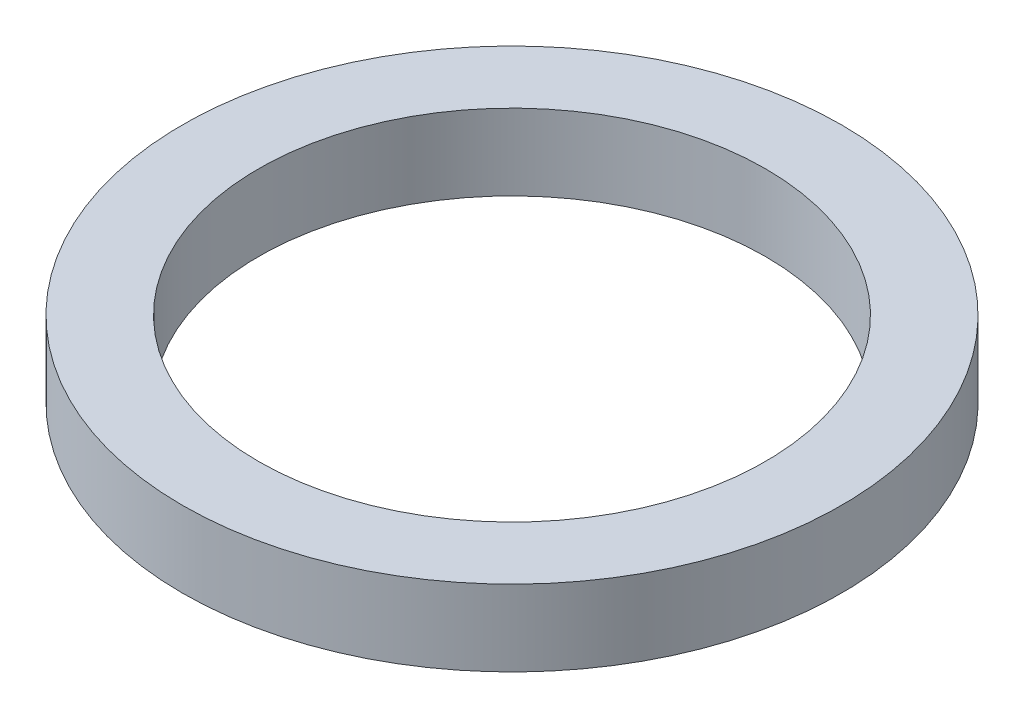
ISO-10303-21;
HEADER;
FILE_DESCRIPTION(('STEP AP214'),'2;1');
FILE_NAME('part.step','',(''),(''),'','','');
FILE_SCHEMA(('AUTOMOTIVE_DESIGN { 1 0 10303 214 1 1 1 1 }'));
ENDSEC;
DATA;
#1=APPLICATION_CONTEXT('core data for automotive mechanical design processes');
#2=APPLICATION_PROTOCOL_DEFINITION('international standard','automotive_design',2000,#1);
#3=PRODUCT_CONTEXT('',#1,'mechanical');
#4=PRODUCT('Part','Part','',(#3));
#5=PRODUCT_RELATED_PRODUCT_CATEGORY('part','',(#4));
#6=PRODUCT_DEFINITION_FORMATION('','',#4);
#7=PRODUCT_DEFINITION_CONTEXT('part definition',#1,'design');
#8=PRODUCT_DEFINITION('design','',#6,#7);
#9=PRODUCT_DEFINITION_SHAPE('','',#8);
#10=(LENGTH_UNIT() NAMED_UNIT(*) SI_UNIT(.MILLI.,.METRE.));
#11=(NAMED_UNIT(*) PLANE_ANGLE_UNIT() SI_UNIT($,.RADIAN.));
#12=(NAMED_UNIT(*) SI_UNIT($,.STERADIAN.) SOLID_ANGLE_UNIT());
#13=UNCERTAINTY_MEASURE_WITH_UNIT(LENGTH_MEASURE(1.E-05),#10,'distance_accuracy_value','');
#14=(GEOMETRIC_REPRESENTATION_CONTEXT(3) GLOBAL_UNCERTAINTY_ASSIGNED_CONTEXT((#13)) GLOBAL_UNIT_ASSIGNED_CONTEXT((#10,
#11,#12)) REPRESENTATION_CONTEXT('',''));
#15=CARTESIAN_POINT('',(0.,0.,0.));
#16=DIRECTION('',(0.,0.,1.));
#17=DIRECTION('',(1.,0.,0.));
#18=AXIS2_PLACEMENT_3D('',#15,#16,#17);
#19=CARTESIAN_POINT('',(0.,15.,0.));
#20=DIRECTION('',(0.,-1.,0.));
#21=DIRECTION('',(0.,0.,-1.));
#22=AXIS2_PLACEMENT_3D('',#19,#20,#21);
#23=CYLINDRICAL_SURFACE('',#22,65.);
#24=CARTESIAN_POINT('',(0.,15.,0.));
#25=DIRECTION('',(0.,1.,0.));
#26=DIRECTION('',(0.,0.,1.));
#27=AXIS2_PLACEMENT_3D('',#24,#25,#26);
#28=CIRCLE('',#27,65.);
#29=CARTESIAN_POINT('',(0.,15.,65.));
#30=VERTEX_POINT('',#29);
#31=EDGE_CURVE('E10',#30,#30,#28,.T.);
#32=ORIENTED_EDGE('',*,*,#31,.F.);
#33=EDGE_LOOP('',(#32));
#34=FACE_BOUND('',#33,.T.);
#35=CARTESIAN_POINT('',(0.,0.,0.));
#36=DIRECTION('',(0.,1.,0.));
#37=DIRECTION('',(0.,0.,1.));
#38=AXIS2_PLACEMENT_3D('',#35,#36,#37);
#39=CIRCLE('',#38,65.);
#40=CARTESIAN_POINT('',(0.,0.,65.));
#41=VERTEX_POINT('',#40);
#42=EDGE_CURVE('E37',#41,#41,#39,.T.);
#43=ORIENTED_EDGE('',*,*,#42,.T.);
#44=EDGE_LOOP('',(#43));
#45=FACE_BOUND('',#44,.T.);
#46=ADVANCED_FACE('F40',(#34,#45),#23,.T.);
#47=CARTESIAN_POINT('',(0.,15.,0.));
#48=DIRECTION('',(0.,1.,0.));
#49=DIRECTION('',(0.,0.,1.));
#50=AXIS2_PLACEMENT_3D('',#47,#48,#49);
#51=PLANE('',#50);
#52=CARTESIAN_POINT('',(0.,15.,0.));
#53=DIRECTION('',(0.,1.,0.));
#54=DIRECTION('',(0.,0.,1.));
#55=AXIS2_PLACEMENT_3D('',#52,#53,#54);
#56=CIRCLE('',#55,50.);
#57=CARTESIAN_POINT('',(0.,15.,50.));
#58=VERTEX_POINT('',#57);
#59=EDGE_CURVE('E50',#58,#58,#56,.T.);
#60=ORIENTED_EDGE('',*,*,#59,.F.);
#61=EDGE_LOOP('',(#60));
#62=FACE_BOUND('',#61,.T.);
#63=ORIENTED_EDGE('',*,*,#31,.T.);
#64=EDGE_LOOP('',(#63));
#65=FACE_BOUND('',#64,.T.);
#66=ADVANCED_FACE('F59',(#62,#65),#51,.T.);
#67=CARTESIAN_POINT('',(0.,0.,0.));
#68=DIRECTION('',(0.,1.,0.));
#69=DIRECTION('',(0.,0.,1.));
#70=AXIS2_PLACEMENT_3D('',#67,#68,#69);
#71=PLANE('',#70);
#72=CARTESIAN_POINT('',(0.,0.,0.));
#73=DIRECTION('',(0.,1.,0.));
#74=DIRECTION('',(0.,0.,1.));
#75=AXIS2_PLACEMENT_3D('',#72,#73,#74);
#76=CIRCLE('',#75,50.);
#77=CARTESIAN_POINT('',(0.,0.,50.));
#78=VERTEX_POINT('',#77);
#79=EDGE_CURVE('E47',#78,#78,#76,.T.);
#80=ORIENTED_EDGE('',*,*,#79,.T.);
#81=EDGE_LOOP('',(#80));
#82=FACE_BOUND('',#81,.T.);
#83=ORIENTED_EDGE('',*,*,#42,.F.);
#84=EDGE_LOOP('',(#83));
#85=FACE_BOUND('',#84,.T.);
#86=ADVANCED_FACE('F58',(#82,#85),#71,.F.);
#87=CARTESIAN_POINT('',(0.,15.,0.));
#88=DIRECTION('',(0.,-1.,0.));
#89=DIRECTION('',(0.,0.,-1.));
#90=AXIS2_PLACEMENT_3D('',#87,#88,#89);
#91=CYLINDRICAL_SURFACE('',#90,50.);
#92=ORIENTED_EDGE('',*,*,#59,.T.);
#93=EDGE_LOOP('',(#92));
#94=FACE_BOUND('',#93,.T.);
#95=ORIENTED_EDGE('',*,*,#79,.F.);
#96=EDGE_LOOP('',(#95));
#97=FACE_BOUND('',#96,.T.);
#98=ADVANCED_FACE('F54',(#94,#97),#91,.F.);
#99=CLOSED_SHELL('',(#46,#66,#86,#98));
#100=MANIFOLD_SOLID_BREP('B2',#99);
#101=ADVANCED_BREP_SHAPE_REPRESENTATION('',(#18,#100),#14);
#102=SHAPE_DEFINITION_REPRESENTATION(#9,#101);
ENDSEC;
END-ISO-10303-21;
